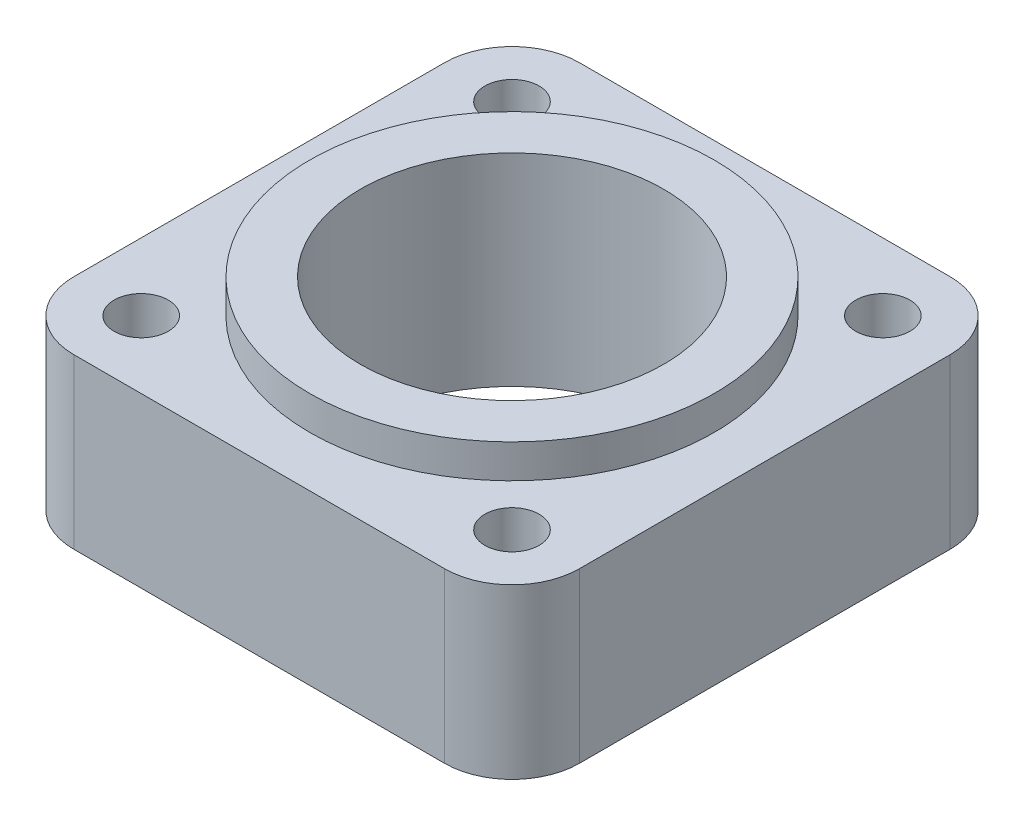
ISO-10303-21;
HEADER;
FILE_DESCRIPTION(('STEP AP214'),'2;1');
FILE_NAME('part.step','',(''),(''),'','','');
FILE_SCHEMA(('AUTOMOTIVE_DESIGN { 1 0 10303 214 1 1 1 1 }'));
ENDSEC;
DATA;
#1=APPLICATION_CONTEXT('core data for automotive mechanical design processes');
#2=APPLICATION_PROTOCOL_DEFINITION('international standard','automotive_design',2000,#1);
#3=PRODUCT_CONTEXT('',#1,'mechanical');
#4=PRODUCT('Part','Part','',(#3));
#5=PRODUCT_RELATED_PRODUCT_CATEGORY('part','',(#4));
#6=PRODUCT_DEFINITION_FORMATION('','',#4);
#7=PRODUCT_DEFINITION_CONTEXT('part definition',#1,'design');
#8=PRODUCT_DEFINITION('design','',#6,#7);
#9=PRODUCT_DEFINITION_SHAPE('','',#8);
#10=(LENGTH_UNIT() NAMED_UNIT(*) SI_UNIT(.MILLI.,.METRE.));
#11=(NAMED_UNIT(*) PLANE_ANGLE_UNIT() SI_UNIT($,.RADIAN.));
#12=(NAMED_UNIT(*) SI_UNIT($,.STERADIAN.) SOLID_ANGLE_UNIT());
#13=UNCERTAINTY_MEASURE_WITH_UNIT(LENGTH_MEASURE(1.E-05),#10,'distance_accuracy_value','');
#14=(GEOMETRIC_REPRESENTATION_CONTEXT(3) GLOBAL_UNCERTAINTY_ASSIGNED_CONTEXT((#13)) GLOBAL_UNIT_ASSIGNED_CONTEXT((#10,
#11,#12)) REPRESENTATION_CONTEXT('',''));
#15=CARTESIAN_POINT('',(0.,0.,0.));
#16=DIRECTION('',(0.,0.,1.));
#17=DIRECTION('',(1.,0.,0.));
#18=AXIS2_PLACEMENT_3D('',#15,#16,#17);
#19=CARTESIAN_POINT('',(-23.8125,15.875,23.8125));
#20=DIRECTION('',(1.,0.,0.));
#21=DIRECTION('',(0.,0.,-1.));
#22=AXIS2_PLACEMENT_3D('',#19,#20,#21);
#23=PLANE('',#22);
#24=DIRECTION('',(0.,0.,1.));
#25=VECTOR('',#24,1.);
#26=CARTESIAN_POINT('',(-23.8125,15.875,23.8125));
#27=LINE('',#26,#25);
#28=CARTESIAN_POINT('',(-23.8125,15.875,-17.4625));
#29=VERTEX_POINT('',#28);
#30=CARTESIAN_POINT('',(-23.8125,15.875,17.4625));
#31=VERTEX_POINT('',#30);
#32=EDGE_CURVE('E122',#29,#31,#27,.T.);
#33=ORIENTED_EDGE('',*,*,#32,.F.);
#34=DIRECTION('',(0.,-1.,0.));
#35=VECTOR('',#34,1.);
#36=CARTESIAN_POINT('',(-23.8125,15.875,-17.4625));
#37=LINE('',#36,#35);
#38=CARTESIAN_POINT('',(-23.8125,0.,-17.4625));
#39=VERTEX_POINT('',#38);
#40=EDGE_CURVE('E107',#29,#39,#37,.T.);
#41=ORIENTED_EDGE('',*,*,#40,.T.);
#42=DIRECTION('',(0.,0.,1.));
#43=VECTOR('',#42,1.);
#44=CARTESIAN_POINT('',(-23.8125,0.,23.8125));
#45=LINE('',#44,#43);
#46=CARTESIAN_POINT('',(-23.8125,0.,17.4625));
#47=VERTEX_POINT('',#46);
#48=EDGE_CURVE('E119',#39,#47,#45,.T.);
#49=ORIENTED_EDGE('',*,*,#48,.T.);
#50=DIRECTION('',(0.,-1.,0.));
#51=VECTOR('',#50,1.);
#52=CARTESIAN_POINT('',(-23.8125,15.875,17.4625));
#53=LINE('',#52,#51);
#54=EDGE_CURVE('E124',#47,#31,#53,.F.);
#55=ORIENTED_EDGE('',*,*,#54,.T.);
#56=EDGE_LOOP('',(#33,#41,#49,#55));
#57=FACE_BOUND('',#56,.T.);
#58=ADVANCED_FACE('F36',(#57),#23,.F.);
#59=CARTESIAN_POINT('',(23.8125,15.875,23.8125));
#60=DIRECTION('',(0.,0.,-1.));
#61=DIRECTION('',(-1.,0.,0.));
#62=AXIS2_PLACEMENT_3D('',#59,#60,#61);
#63=PLANE('',#62);
#64=DIRECTION('',(1.,0.,0.));
#65=VECTOR('',#64,1.);
#66=CARTESIAN_POINT('',(23.8125,15.875,23.8125));
#67=LINE('',#66,#65);
#68=CARTESIAN_POINT('',(-17.4625,15.875,23.8125));
#69=VERTEX_POINT('',#68);
#70=CARTESIAN_POINT('',(17.4625,15.875,23.8125));
#71=VERTEX_POINT('',#70);
#72=EDGE_CURVE('E167',#69,#71,#67,.T.);
#73=ORIENTED_EDGE('',*,*,#72,.F.);
#74=DIRECTION('',(0.,-1.,0.));
#75=VECTOR('',#74,1.);
#76=CARTESIAN_POINT('',(-17.4625,15.875,23.8125));
#77=LINE('',#76,#75);
#78=CARTESIAN_POINT('',(-17.4625,0.,23.8125));
#79=VERTEX_POINT('',#78);
#80=EDGE_CURVE('E11',#69,#79,#77,.T.);
#81=ORIENTED_EDGE('',*,*,#80,.T.);
#82=DIRECTION('',(1.,0.,0.));
#83=VECTOR('',#82,1.);
#84=CARTESIAN_POINT('',(23.8125,0.,23.8125));
#85=LINE('',#84,#83);
#86=CARTESIAN_POINT('',(17.4625,0.,23.8125));
#87=VERTEX_POINT('',#86);
#88=EDGE_CURVE('E129',#79,#87,#85,.T.);
#89=ORIENTED_EDGE('',*,*,#88,.T.);
#90=DIRECTION('',(0.,-1.,0.));
#91=VECTOR('',#90,1.);
#92=CARTESIAN_POINT('',(17.4625,15.875,23.8125));
#93=LINE('',#92,#91);
#94=EDGE_CURVE('E44',#87,#71,#93,.F.);
#95=ORIENTED_EDGE('',*,*,#94,.T.);
#96=EDGE_LOOP('',(#73,#81,#89,#95));
#97=FACE_BOUND('',#96,.T.);
#98=ADVANCED_FACE('F166',(#97),#63,.F.);
#99=CARTESIAN_POINT('',(23.8125,15.875,23.8125));
#100=DIRECTION('',(-1.,0.,0.));
#101=DIRECTION('',(0.,0.,1.));
#102=AXIS2_PLACEMENT_3D('',#99,#100,#101);
#103=PLANE('',#102);
#104=DIRECTION('',(0.,0.,-1.));
#105=VECTOR('',#104,1.);
#106=CARTESIAN_POINT('',(23.8125,0.,23.8125));
#107=LINE('',#106,#105);
#108=CARTESIAN_POINT('',(23.8125,0.,17.4625));
#109=VERTEX_POINT('',#108);
#110=CARTESIAN_POINT('',(23.8125,0.,-17.4625));
#111=VERTEX_POINT('',#110);
#112=EDGE_CURVE('E133',#109,#111,#107,.T.);
#113=ORIENTED_EDGE('',*,*,#112,.T.);
#114=DIRECTION('',(0.,-1.,0.));
#115=VECTOR('',#114,1.);
#116=CARTESIAN_POINT('',(23.8125,15.875,-17.4625));
#117=LINE('',#116,#115);
#118=CARTESIAN_POINT('',(23.8125,15.875,-17.4625));
#119=VERTEX_POINT('',#118);
#120=EDGE_CURVE('E51',#111,#119,#117,.F.);
#121=ORIENTED_EDGE('',*,*,#120,.T.);
#122=DIRECTION('',(0.,0.,-1.));
#123=VECTOR('',#122,1.);
#124=CARTESIAN_POINT('',(23.8125,15.875,23.8125));
#125=LINE('',#124,#123);
#126=CARTESIAN_POINT('',(23.8125,15.875,17.4625));
#127=VERTEX_POINT('',#126);
#128=EDGE_CURVE('E173',#127,#119,#125,.T.);
#129=ORIENTED_EDGE('',*,*,#128,.F.);
#130=DIRECTION('',(0.,-1.,0.));
#131=VECTOR('',#130,1.);
#132=CARTESIAN_POINT('',(23.8125,15.875,17.4625));
#133=LINE('',#132,#131);
#134=EDGE_CURVE('E160',#127,#109,#133,.T.);
#135=ORIENTED_EDGE('',*,*,#134,.T.);
#136=EDGE_LOOP('',(#113,#121,#129,#135));
#137=FACE_BOUND('',#136,.T.);
#138=ADVANCED_FACE('F177',(#137),#103,.F.);
#139=CARTESIAN_POINT('',(23.8125,15.875,-23.8125));
#140=DIRECTION('',(0.,0.,1.));
#141=DIRECTION('',(1.,0.,0.));
#142=AXIS2_PLACEMENT_3D('',#139,#140,#141);
#143=PLANE('',#142);
#144=DIRECTION('',(-1.,0.,0.));
#145=VECTOR('',#144,1.);
#146=CARTESIAN_POINT('',(23.8125,0.,-23.8125));
#147=LINE('',#146,#145);
#148=CARTESIAN_POINT('',(17.4625,0.,-23.8125));
#149=VERTEX_POINT('',#148);
#150=CARTESIAN_POINT('',(-17.4625,0.,-23.8125));
#151=VERTEX_POINT('',#150);
#152=EDGE_CURVE('E143',#149,#151,#147,.T.);
#153=ORIENTED_EDGE('',*,*,#152,.T.);
#154=DIRECTION('',(0.,-1.,0.));
#155=VECTOR('',#154,1.);
#156=CARTESIAN_POINT('',(-17.4625,15.875,-23.8125));
#157=LINE('',#156,#155);
#158=CARTESIAN_POINT('',(-17.4625,15.875,-23.8125));
#159=VERTEX_POINT('',#158);
#160=EDGE_CURVE('E108',#151,#159,#157,.F.);
#161=ORIENTED_EDGE('',*,*,#160,.T.);
#162=DIRECTION('',(-1.,0.,0.));
#163=VECTOR('',#162,1.);
#164=CARTESIAN_POINT('',(23.8125,15.875,-23.8125));
#165=LINE('',#164,#163);
#166=CARTESIAN_POINT('',(17.4625,15.875,-23.8125));
#167=VERTEX_POINT('',#166);
#168=EDGE_CURVE('E139',#167,#159,#165,.T.);
#169=ORIENTED_EDGE('',*,*,#168,.F.);
#170=DIRECTION('',(0.,-1.,0.));
#171=VECTOR('',#170,1.);
#172=CARTESIAN_POINT('',(17.4625,15.875,-23.8125));
#173=LINE('',#172,#171);
#174=EDGE_CURVE('E113',#167,#149,#173,.T.);
#175=ORIENTED_EDGE('',*,*,#174,.T.);
#176=EDGE_LOOP('',(#153,#161,#169,#175));
#177=FACE_BOUND('',#176,.T.);
#178=ADVANCED_FACE('F184',(#177),#143,.F.);
#179=CARTESIAN_POINT('',(0.,15.875,0.));
#180=DIRECTION('',(0.,1.,0.));
#181=DIRECTION('',(0.,0.,1.));
#182=AXIS2_PLACEMENT_3D('',#179,#180,#181);
#183=PLANE('',#182);
#184=CARTESIAN_POINT('',(-17.4625,15.875,-17.4625));
#185=DIRECTION('',(0.,1.,0.));
#186=DIRECTION('',(0.,0.,1.));
#187=AXIS2_PLACEMENT_3D('',#184,#185,#186);
#188=CIRCLE('',#187,2.5527);
#189=CARTESIAN_POINT('',(-17.4625,15.875,-14.9098));
#190=VERTEX_POINT('',#189);
#191=EDGE_CURVE('E215',#190,#190,#188,.T.);
#192=ORIENTED_EDGE('',*,*,#191,.F.);
#193=EDGE_LOOP('',(#192));
#194=FACE_BOUND('',#193,.T.);
#195=CARTESIAN_POINT('',(17.4625,15.875,-17.4625));
#196=DIRECTION('',(0.,1.,0.));
#197=DIRECTION('',(0.,0.,1.));
#198=AXIS2_PLACEMENT_3D('',#195,#196,#197);
#199=CIRCLE('',#198,2.5527);
#200=CARTESIAN_POINT('',(17.4625,15.875,-14.9098));
#201=VERTEX_POINT('',#200);
#202=EDGE_CURVE('E209',#201,#201,#199,.T.);
#203=ORIENTED_EDGE('',*,*,#202,.F.);
#204=EDGE_LOOP('',(#203));
#205=FACE_BOUND('',#204,.T.);
#206=CARTESIAN_POINT('',(17.4625,15.875,17.4625));
#207=DIRECTION('',(0.,1.,0.));
#208=DIRECTION('',(0.,0.,1.));
#209=AXIS2_PLACEMENT_3D('',#206,#207,#208);
#210=CIRCLE('',#209,2.5527);
#211=CARTESIAN_POINT('',(17.4625,15.875,20.0152));
#212=VERTEX_POINT('',#211);
#213=EDGE_CURVE('E203',#212,#212,#210,.T.);
#214=ORIENTED_EDGE('',*,*,#213,.F.);
#215=EDGE_LOOP('',(#214));
#216=FACE_BOUND('',#215,.T.);
#217=CARTESIAN_POINT('',(-17.4625,15.875,17.4625));
#218=DIRECTION('',(0.,1.,0.));
#219=DIRECTION('',(0.,0.,1.));
#220=AXIS2_PLACEMENT_3D('',#217,#218,#219);
#221=CIRCLE('',#220,2.5527);
#222=CARTESIAN_POINT('',(-17.4625,15.875,20.0152));
#223=VERTEX_POINT('',#222);
#224=EDGE_CURVE('E197',#223,#223,#221,.T.);
#225=ORIENTED_EDGE('',*,*,#224,.F.);
#226=EDGE_LOOP('',(#225));
#227=FACE_BOUND('',#226,.T.);
#228=CARTESIAN_POINT('',(0.,15.875,0.));
#229=DIRECTION('',(0.,1.,0.));
#230=DIRECTION('',(0.,0.,1.));
#231=AXIS2_PLACEMENT_3D('',#228,#229,#230);
#232=CIRCLE('',#231,19.05);
#233=CARTESIAN_POINT('',(0.,15.875,19.05));
#234=VERTEX_POINT('',#233);
#235=EDGE_CURVE('E145',#234,#234,#232,.T.);
#236=ORIENTED_EDGE('',*,*,#235,.F.);
#237=EDGE_LOOP('',(#236));
#238=FACE_BOUND('',#237,.T.);
#239=ORIENTED_EDGE('',*,*,#168,.T.);
#240=CARTESIAN_POINT('',(-17.4625,15.875,-17.4625));
#241=DIRECTION('',(0.,1.,0.));
#242=DIRECTION('',(0.,0.,1.));
#243=AXIS2_PLACEMENT_3D('',#240,#241,#242);
#244=CIRCLE('',#243,6.35);
#245=EDGE_CURVE('E158',#159,#29,#244,.T.);
#246=ORIENTED_EDGE('',*,*,#245,.T.);
#247=ORIENTED_EDGE('',*,*,#32,.T.);
#248=CARTESIAN_POINT('',(-17.4625,15.875,17.4625));
#249=DIRECTION('',(0.,1.,0.));
#250=DIRECTION('',(0.,0.,1.));
#251=AXIS2_PLACEMENT_3D('',#248,#249,#250);
#252=CIRCLE('',#251,6.35);
#253=EDGE_CURVE('E154',#31,#69,#252,.T.);
#254=ORIENTED_EDGE('',*,*,#253,.T.);
#255=ORIENTED_EDGE('',*,*,#72,.T.);
#256=CARTESIAN_POINT('',(17.4625,15.875,17.4625));
#257=DIRECTION('',(0.,1.,0.));
#258=DIRECTION('',(0.,0.,1.));
#259=AXIS2_PLACEMENT_3D('',#256,#257,#258);
#260=CIRCLE('',#259,6.35);
#261=EDGE_CURVE('E58',#71,#127,#260,.T.);
#262=ORIENTED_EDGE('',*,*,#261,.T.);
#263=ORIENTED_EDGE('',*,*,#128,.T.);
#264=CARTESIAN_POINT('',(17.4625,15.875,-17.4625));
#265=DIRECTION('',(0.,1.,0.));
#266=DIRECTION('',(0.,0.,1.));
#267=AXIS2_PLACEMENT_3D('',#264,#265,#266);
#268=CIRCLE('',#267,6.35);
#269=EDGE_CURVE('E156',#119,#167,#268,.T.);
#270=ORIENTED_EDGE('',*,*,#269,.T.);
#271=EDGE_LOOP('',(#239,#246,#247,#254,#255,#262,#263,#270));
#272=FACE_BOUND('',#271,.T.);
#273=ADVANCED_FACE('F171',(#194,#205,#216,#227,#238,#272),#183,.T.);
#274=CARTESIAN_POINT('',(0.,0.,0.));
#275=DIRECTION('',(0.,1.,0.));
#276=DIRECTION('',(0.,0.,1.));
#277=AXIS2_PLACEMENT_3D('',#274,#275,#276);
#278=PLANE('',#277);
#279=CARTESIAN_POINT('',(-17.4625,0.,-17.4625));
#280=DIRECTION('',(0.,1.,0.));
#281=DIRECTION('',(0.,0.,1.));
#282=AXIS2_PLACEMENT_3D('',#279,#280,#281);
#283=CIRCLE('',#282,2.5527);
#284=CARTESIAN_POINT('',(-17.4625,0.,-14.9098));
#285=VERTEX_POINT('',#284);
#286=EDGE_CURVE('E212',#285,#285,#283,.T.);
#287=ORIENTED_EDGE('',*,*,#286,.T.);
#288=EDGE_LOOP('',(#287));
#289=FACE_BOUND('',#288,.T.);
#290=CARTESIAN_POINT('',(17.4625,0.,-17.4625));
#291=DIRECTION('',(0.,1.,0.));
#292=DIRECTION('',(0.,0.,1.));
#293=AXIS2_PLACEMENT_3D('',#290,#291,#292);
#294=CIRCLE('',#293,2.55269999999999);
#295=CARTESIAN_POINT('',(17.4625,0.,-14.9098));
#296=VERTEX_POINT('',#295);
#297=EDGE_CURVE('E206',#296,#296,#294,.T.);
#298=ORIENTED_EDGE('',*,*,#297,.T.);
#299=EDGE_LOOP('',(#298));
#300=FACE_BOUND('',#299,.T.);
#301=CARTESIAN_POINT('',(17.4625,0.,17.4625));
#302=DIRECTION('',(0.,1.,0.));
#303=DIRECTION('',(0.,0.,1.));
#304=AXIS2_PLACEMENT_3D('',#301,#302,#303);
#305=CIRCLE('',#304,2.55269999999999);
#306=CARTESIAN_POINT('',(17.4625,0.,20.0152));
#307=VERTEX_POINT('',#306);
#308=EDGE_CURVE('E200',#307,#307,#305,.T.);
#309=ORIENTED_EDGE('',*,*,#308,.T.);
#310=EDGE_LOOP('',(#309));
#311=FACE_BOUND('',#310,.T.);
#312=CARTESIAN_POINT('',(-17.4625,0.,17.4625));
#313=DIRECTION('',(0.,1.,0.));
#314=DIRECTION('',(0.,0.,1.));
#315=AXIS2_PLACEMENT_3D('',#312,#313,#314);
#316=CIRCLE('',#315,2.5527);
#317=CARTESIAN_POINT('',(-17.4625,0.,20.0152));
#318=VERTEX_POINT('',#317);
#319=EDGE_CURVE('E192',#318,#318,#316,.T.);
#320=ORIENTED_EDGE('',*,*,#319,.T.);
#321=EDGE_LOOP('',(#320));
#322=FACE_BOUND('',#321,.T.);
#323=CARTESIAN_POINT('',(0.,0.,0.));
#324=DIRECTION('',(0.,1.,0.));
#325=DIRECTION('',(0.,0.,1.));
#326=AXIS2_PLACEMENT_3D('',#323,#324,#325);
#327=CIRCLE('',#326,14.2875);
#328=CARTESIAN_POINT('',(0.,0.,14.2875));
#329=VERTEX_POINT('',#328);
#330=EDGE_CURVE('E136',#329,#329,#327,.T.);
#331=ORIENTED_EDGE('',*,*,#330,.T.);
#332=EDGE_LOOP('',(#331));
#333=FACE_BOUND('',#332,.T.);
#334=ORIENTED_EDGE('',*,*,#48,.F.);
#335=CARTESIAN_POINT('',(-17.4625,0.,-17.4625));
#336=DIRECTION('',(0.,1.,0.));
#337=DIRECTION('',(0.,0.,1.));
#338=AXIS2_PLACEMENT_3D('',#335,#336,#337);
#339=CIRCLE('',#338,6.35);
#340=EDGE_CURVE('E103',#39,#151,#339,.F.);
#341=ORIENTED_EDGE('',*,*,#340,.T.);
#342=ORIENTED_EDGE('',*,*,#152,.F.);
#343=CARTESIAN_POINT('',(17.4625,0.,-17.4625));
#344=DIRECTION('',(0.,1.,0.));
#345=DIRECTION('',(0.,0.,1.));
#346=AXIS2_PLACEMENT_3D('',#343,#344,#345);
#347=CIRCLE('',#346,6.35);
#348=EDGE_CURVE('E114',#149,#111,#347,.F.);
#349=ORIENTED_EDGE('',*,*,#348,.T.);
#350=ORIENTED_EDGE('',*,*,#112,.F.);
#351=CARTESIAN_POINT('',(17.4625,0.,17.4625));
#352=DIRECTION('',(0.,1.,0.));
#353=DIRECTION('',(0.,0.,1.));
#354=AXIS2_PLACEMENT_3D('',#351,#352,#353);
#355=CIRCLE('',#354,6.35);
#356=EDGE_CURVE('E123',#109,#87,#355,.F.);
#357=ORIENTED_EDGE('',*,*,#356,.T.);
#358=ORIENTED_EDGE('',*,*,#88,.F.);
#359=CARTESIAN_POINT('',(-17.4625,0.,17.4625));
#360=DIRECTION('',(0.,1.,0.));
#361=DIRECTION('',(0.,0.,1.));
#362=AXIS2_PLACEMENT_3D('',#359,#360,#361);
#363=CIRCLE('',#362,6.35);
#364=EDGE_CURVE('E128',#79,#47,#363,.F.);
#365=ORIENTED_EDGE('',*,*,#364,.T.);
#366=EDGE_LOOP('',(#334,#341,#342,#349,#350,#357,#358,#365));
#367=FACE_BOUND('',#366,.T.);
#368=ADVANCED_FACE('F126',(#289,#300,#311,#322,#333,#367),#278,.F.);
#369=CARTESIAN_POINT('',(0.,19.05,0.));
#370=DIRECTION('',(0.,-1.,0.));
#371=DIRECTION('',(0.,0.,-1.));
#372=AXIS2_PLACEMENT_3D('',#369,#370,#371);
#373=CYLINDRICAL_SURFACE('',#372,19.05);
#374=CARTESIAN_POINT('',(0.,19.05,0.));
#375=DIRECTION('',(0.,1.,0.));
#376=DIRECTION('',(0.,0.,1.));
#377=AXIS2_PLACEMENT_3D('',#374,#375,#376);
#378=CIRCLE('',#377,19.05);
#379=CARTESIAN_POINT('',(0.,19.05,19.05));
#380=VERTEX_POINT('',#379);
#381=EDGE_CURVE('E130',#380,#380,#378,.T.);
#382=ORIENTED_EDGE('',*,*,#381,.F.);
#383=EDGE_LOOP('',(#382));
#384=FACE_BOUND('',#383,.T.);
#385=ORIENTED_EDGE('',*,*,#235,.T.);
#386=EDGE_LOOP('',(#385));
#387=FACE_BOUND('',#386,.T.);
#388=ADVANCED_FACE('F232',(#384,#387),#373,.T.);
#389=CARTESIAN_POINT('',(0.,19.05,0.));
#390=DIRECTION('',(0.,1.,0.));
#391=DIRECTION('',(0.,0.,1.));
#392=AXIS2_PLACEMENT_3D('',#389,#390,#391);
#393=PLANE('',#392);
#394=CARTESIAN_POINT('',(0.,19.05,0.));
#395=DIRECTION('',(0.,1.,0.));
#396=DIRECTION('',(0.,0.,1.));
#397=AXIS2_PLACEMENT_3D('',#394,#395,#396);
#398=CIRCLE('',#397,14.2875);
#399=CARTESIAN_POINT('',(0.,19.05,14.2875));
#400=VERTEX_POINT('',#399);
#401=EDGE_CURVE('E189',#400,#400,#398,.T.);
#402=ORIENTED_EDGE('',*,*,#401,.F.);
#403=EDGE_LOOP('',(#402));
#404=FACE_BOUND('',#403,.T.);
#405=ORIENTED_EDGE('',*,*,#381,.T.);
#406=EDGE_LOOP('',(#405));
#407=FACE_BOUND('',#406,.T.);
#408=ADVANCED_FACE('F234',(#404,#407),#393,.T.);
#409=CARTESIAN_POINT('',(0.,0.,0.));
#410=DIRECTION('',(0.,1.,0.));
#411=DIRECTION('',(0.,0.,1.));
#412=AXIS2_PLACEMENT_3D('',#409,#410,#411);
#413=CYLINDRICAL_SURFACE('',#412,14.2875);
#414=ORIENTED_EDGE('',*,*,#330,.F.);
#415=EDGE_LOOP('',(#414));
#416=FACE_BOUND('',#415,.T.);
#417=ORIENTED_EDGE('',*,*,#401,.T.);
#418=EDGE_LOOP('',(#417));
#419=FACE_BOUND('',#418,.T.);
#420=ADVANCED_FACE('F241',(#416,#419),#413,.F.);
#421=CARTESIAN_POINT('',(-17.4625,15.875,17.4625));
#422=DIRECTION('',(0.,1.,0.));
#423=DIRECTION('',(0.,0.,1.));
#424=AXIS2_PLACEMENT_3D('',#421,#422,#423);
#425=CYLINDRICAL_SURFACE('',#424,2.5527);
#426=ORIENTED_EDGE('',*,*,#319,.F.);
#427=EDGE_LOOP('',(#426));
#428=FACE_BOUND('',#427,.T.);
#429=ORIENTED_EDGE('',*,*,#224,.T.);
#430=EDGE_LOOP('',(#429));
#431=FACE_BOUND('',#430,.T.);
#432=ADVANCED_FACE('F356',(#428,#431),#425,.F.);
#433=CARTESIAN_POINT('',(17.4625,15.875,17.4625));
#434=DIRECTION('',(0.,1.,0.));
#435=DIRECTION('',(0.,0.,1.));
#436=AXIS2_PLACEMENT_3D('',#433,#434,#435);
#437=CYLINDRICAL_SURFACE('',#436,2.5527);
#438=ORIENTED_EDGE('',*,*,#308,.F.);
#439=EDGE_LOOP('',(#438));
#440=FACE_BOUND('',#439,.T.);
#441=ORIENTED_EDGE('',*,*,#213,.T.);
#442=EDGE_LOOP('',(#441));
#443=FACE_BOUND('',#442,.T.);
#444=ADVANCED_FACE('F344',(#440,#443),#437,.F.);
#445=CARTESIAN_POINT('',(17.4625,15.875,-17.4625));
#446=DIRECTION('',(0.,1.,0.));
#447=DIRECTION('',(0.,0.,1.));
#448=AXIS2_PLACEMENT_3D('',#445,#446,#447);
#449=CYLINDRICAL_SURFACE('',#448,2.5527);
#450=ORIENTED_EDGE('',*,*,#297,.F.);
#451=EDGE_LOOP('',(#450));
#452=FACE_BOUND('',#451,.T.);
#453=ORIENTED_EDGE('',*,*,#202,.T.);
#454=EDGE_LOOP('',(#453));
#455=FACE_BOUND('',#454,.T.);
#456=ADVANCED_FACE('F333',(#452,#455),#449,.F.);
#457=CARTESIAN_POINT('',(-17.4625,15.875,-17.4625));
#458=DIRECTION('',(0.,1.,0.));
#459=DIRECTION('',(0.,0.,1.));
#460=AXIS2_PLACEMENT_3D('',#457,#458,#459);
#461=CYLINDRICAL_SURFACE('',#460,2.5527);
#462=ORIENTED_EDGE('',*,*,#286,.F.);
#463=EDGE_LOOP('',(#462));
#464=FACE_BOUND('',#463,.T.);
#465=ORIENTED_EDGE('',*,*,#191,.T.);
#466=EDGE_LOOP('',(#465));
#467=FACE_BOUND('',#466,.T.);
#468=ADVANCED_FACE('F219',(#464,#467),#461,.F.);
#469=CARTESIAN_POINT('',(-17.4625,15.875,-17.4625));
#470=DIRECTION('',(0.,-1.,0.));
#471=DIRECTION('',(0.,0.,-1.));
#472=AXIS2_PLACEMENT_3D('',#469,#470,#471);
#473=CYLINDRICAL_SURFACE('',#472,6.35);
#474=ORIENTED_EDGE('',*,*,#245,.F.);
#475=ORIENTED_EDGE('',*,*,#160,.F.);
#476=ORIENTED_EDGE('',*,*,#340,.F.);
#477=ORIENTED_EDGE('',*,*,#40,.F.);
#478=EDGE_LOOP('',(#474,#475,#476,#477));
#479=FACE_BOUND('',#478,.T.);
#480=ADVANCED_FACE('F106',(#479),#473,.T.);
#481=CARTESIAN_POINT('',(17.4625,15.875,-17.4625));
#482=DIRECTION('',(0.,-1.,0.));
#483=DIRECTION('',(0.,0.,-1.));
#484=AXIS2_PLACEMENT_3D('',#481,#482,#483);
#485=CYLINDRICAL_SURFACE('',#484,6.35);
#486=ORIENTED_EDGE('',*,*,#269,.F.);
#487=ORIENTED_EDGE('',*,*,#120,.F.);
#488=ORIENTED_EDGE('',*,*,#348,.F.);
#489=ORIENTED_EDGE('',*,*,#174,.F.);
#490=EDGE_LOOP('',(#486,#487,#488,#489));
#491=FACE_BOUND('',#490,.T.);
#492=ADVANCED_FACE('F181',(#491),#485,.T.);
#493=CARTESIAN_POINT('',(-17.4625,15.875,17.4625));
#494=DIRECTION('',(0.,-1.,0.));
#495=DIRECTION('',(0.,0.,-1.));
#496=AXIS2_PLACEMENT_3D('',#493,#494,#495);
#497=CYLINDRICAL_SURFACE('',#496,6.35);
#498=ORIENTED_EDGE('',*,*,#253,.F.);
#499=ORIENTED_EDGE('',*,*,#54,.F.);
#500=ORIENTED_EDGE('',*,*,#364,.F.);
#501=ORIENTED_EDGE('',*,*,#80,.F.);
#502=EDGE_LOOP('',(#498,#499,#500,#501));
#503=FACE_BOUND('',#502,.T.);
#504=ADVANCED_FACE('F258',(#503),#497,.T.);
#505=CARTESIAN_POINT('',(17.4625,15.875,17.4625));
#506=DIRECTION('',(0.,-1.,0.));
#507=DIRECTION('',(0.,0.,-1.));
#508=AXIS2_PLACEMENT_3D('',#505,#506,#507);
#509=CYLINDRICAL_SURFACE('',#508,6.35);
#510=ORIENTED_EDGE('',*,*,#261,.F.);
#511=ORIENTED_EDGE('',*,*,#94,.F.);
#512=ORIENTED_EDGE('',*,*,#356,.F.);
#513=ORIENTED_EDGE('',*,*,#134,.F.);
#514=EDGE_LOOP('',(#510,#511,#512,#513));
#515=FACE_BOUND('',#514,.T.);
#516=ADVANCED_FACE('F38',(#515),#509,.T.);
#517=CLOSED_SHELL('',(#58,#98,#138,#178,#273,#368,#388,#408,#420,#432,#444,#456,#468,#480,#492,
#504,#516));
#518=MANIFOLD_SOLID_BREP('B2',#517);
#519=ADVANCED_BREP_SHAPE_REPRESENTATION('',(#18,#518),#14);
#520=SHAPE_DEFINITION_REPRESENTATION(#9,#519);
ENDSEC;
END-ISO-10303-21;
